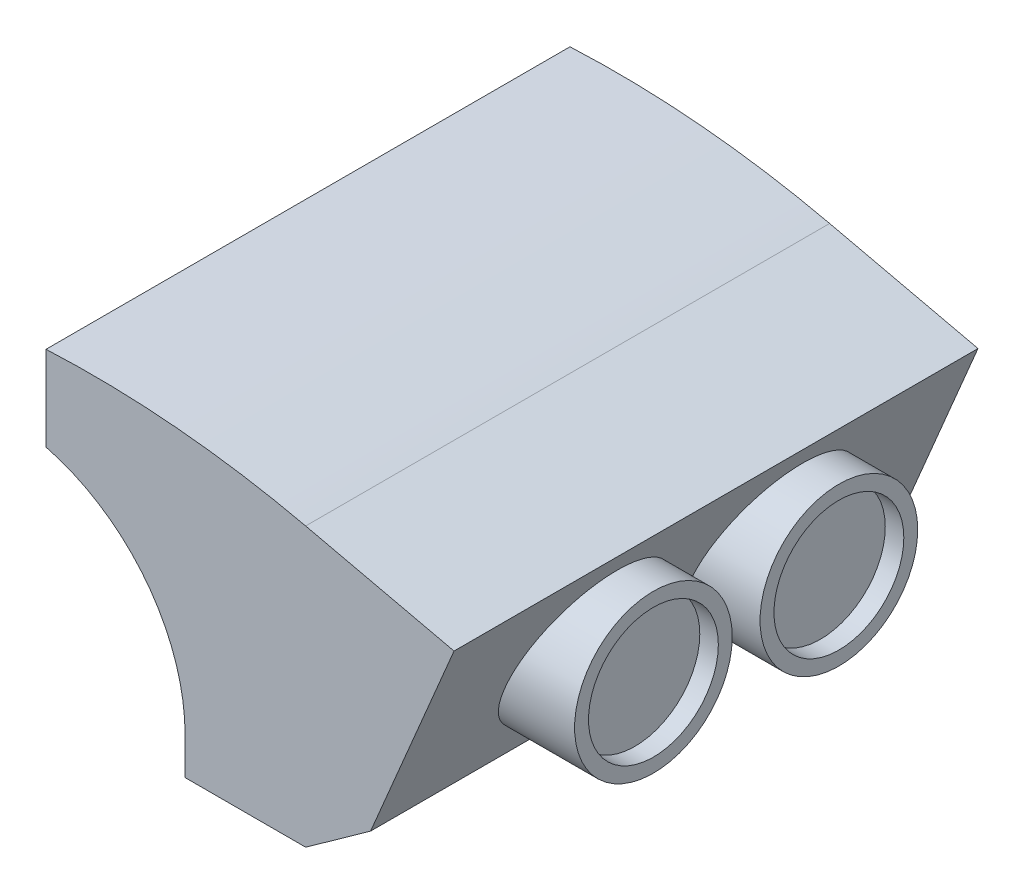
ISO-10303-21;
HEADER;
FILE_DESCRIPTION(('STEP AP214'),'2;1');
FILE_NAME('part.step','',(''),(''),'','','');
FILE_SCHEMA(('AUTOMOTIVE_DESIGN { 1 0 10303 214 1 1 1 1 }'));
ENDSEC;
DATA;
#1=APPLICATION_CONTEXT('core data for automotive mechanical design processes');
#2=APPLICATION_PROTOCOL_DEFINITION('international standard','automotive_design',2000,#1);
#3=PRODUCT_CONTEXT('',#1,'mechanical');
#4=PRODUCT('Part','Part','',(#3));
#5=PRODUCT_RELATED_PRODUCT_CATEGORY('part','',(#4));
#6=PRODUCT_DEFINITION_FORMATION('','',#4);
#7=PRODUCT_DEFINITION_CONTEXT('part definition',#1,'design');
#8=PRODUCT_DEFINITION('design','',#6,#7);
#9=PRODUCT_DEFINITION_SHAPE('','',#8);
#10=(LENGTH_UNIT() NAMED_UNIT(*) SI_UNIT(.MILLI.,.METRE.));
#11=(NAMED_UNIT(*) PLANE_ANGLE_UNIT() SI_UNIT($,.RADIAN.));
#12=(NAMED_UNIT(*) SI_UNIT($,.STERADIAN.) SOLID_ANGLE_UNIT());
#13=UNCERTAINTY_MEASURE_WITH_UNIT(LENGTH_MEASURE(1.E-05),#10,'distance_accuracy_value','');
#14=(GEOMETRIC_REPRESENTATION_CONTEXT(3) GLOBAL_UNCERTAINTY_ASSIGNED_CONTEXT((#13)) GLOBAL_UNIT_ASSIGNED_CONTEXT((#10,
#11,#12)) REPRESENTATION_CONTEXT('',''));
#15=CARTESIAN_POINT('',(0.,0.,0.));
#16=DIRECTION('',(0.,0.,1.));
#17=DIRECTION('',(1.,0.,0.));
#18=AXIS2_PLACEMENT_3D('',#15,#16,#17);
#19=CARTESIAN_POINT('',(-15.,-1.5,17.5));
#20=DIRECTION('',(0.,0.,-1.));
#21=DIRECTION('',(1.,0.,0.));
#22=AXIS2_PLACEMENT_3D('',#19,#20,#21);
#23=PLANE('',#22);
#24=DIRECTION('',(-1.,0.,0.));
#25=VECTOR('',#24,1.);
#26=CARTESIAN_POINT('',(-14.,-1.,17.5));
#27=LINE('',#26,#25);
#28=CARTESIAN_POINT('',(-14.,-1.,17.5));
#29=VERTEX_POINT('',#28);
#30=CARTESIAN_POINT('',(-15.,-1.,17.5));
#31=VERTEX_POINT('',#30);
#32=EDGE_CURVE('E272',#29,#31,#27,.T.);
#33=ORIENTED_EDGE('',*,*,#32,.F.);
#34=DIRECTION('',(0.,-1.,0.));
#35=VECTOR('',#34,1.);
#36=CARTESIAN_POINT('',(-14.,-30.,17.5));
#37=LINE('',#36,#35);
#38=CARTESIAN_POINT('',(-14.,-2.,17.5));
#39=VERTEX_POINT('',#38);
#40=EDGE_CURVE('E306',#29,#39,#37,.T.);
#41=ORIENTED_EDGE('',*,*,#40,.T.);
#42=DIRECTION('',(-1.,0.,0.));
#43=VECTOR('',#42,1.);
#44=CARTESIAN_POINT('',(-14.,-2.,17.5));
#45=LINE('',#44,#43);
#46=CARTESIAN_POINT('',(-15.,-2.,17.5));
#47=VERTEX_POINT('',#46);
#48=EDGE_CURVE('E275',#39,#47,#45,.T.);
#49=ORIENTED_EDGE('',*,*,#48,.T.);
#50=CARTESIAN_POINT('',(-15.,-1.5,17.5));
#51=DIRECTION('',(0.,0.,1.));
#52=DIRECTION('',(1.,0.,0.));
#53=AXIS2_PLACEMENT_3D('',#50,#51,#52);
#54=CIRCLE('',#53,0.5);
#55=EDGE_CURVE('E277',#31,#47,#54,.T.);
#56=ORIENTED_EDGE('',*,*,#55,.F.);
#57=EDGE_LOOP('',(#33,#41,#49,#56));
#58=FACE_BOUND('',#57,.T.);
#59=CARTESIAN_POINT('',(-15.,-1.5,17.5));
#60=DIRECTION('',(0.,0.,-1.));
#61=DIRECTION('',(-1.,0.,0.));
#62=AXIS2_PLACEMENT_3D('',#59,#60,#61);
#63=CIRCLE('',#62,0.349999999999999);
#64=CARTESIAN_POINT('',(-15.35,-1.5,17.5));
#65=VERTEX_POINT('',#64);
#66=EDGE_CURVE('E265',#65,#65,#63,.T.);
#67=ORIENTED_EDGE('',*,*,#66,.F.);
#68=EDGE_LOOP('',(#67));
#69=FACE_BOUND('',#68,.T.);
#70=ADVANCED_FACE('F36',(#58,#69),#23,.T.);
#71=CARTESIAN_POINT('',(-15.,-1.5,22.5));
#72=DIRECTION('',(0.,0.,-1.));
#73=DIRECTION('',(1.,0.,0.));
#74=AXIS2_PLACEMENT_3D('',#71,#72,#73);
#75=PLANE('',#74);
#76=DIRECTION('',(0.,-1.,0.));
#77=VECTOR('',#76,1.);
#78=CARTESIAN_POINT('',(-14.,-30.,22.5));
#79=LINE('',#78,#77);
#80=CARTESIAN_POINT('',(-14.,-1.,22.5));
#81=VERTEX_POINT('',#80);
#82=CARTESIAN_POINT('',(-14.,-2.,22.5));
#83=VERTEX_POINT('',#82);
#84=EDGE_CURVE('E302',#81,#83,#79,.T.);
#85=ORIENTED_EDGE('',*,*,#84,.F.);
#86=DIRECTION('',(-1.,0.,0.));
#87=VECTOR('',#86,1.);
#88=CARTESIAN_POINT('',(-12.5,-1.,22.5));
#89=LINE('',#88,#87);
#90=CARTESIAN_POINT('',(-15.,-1.,22.5));
#91=VERTEX_POINT('',#90);
#92=EDGE_CURVE('E268',#81,#91,#89,.T.);
#93=ORIENTED_EDGE('',*,*,#92,.T.);
#94=CARTESIAN_POINT('',(-15.,-1.5,22.5));
#95=DIRECTION('',(0.,0.,1.));
#96=DIRECTION('',(1.,0.,0.));
#97=AXIS2_PLACEMENT_3D('',#94,#95,#96);
#98=CIRCLE('',#97,0.5);
#99=CARTESIAN_POINT('',(-15.,-2.,22.5));
#100=VERTEX_POINT('',#99);
#101=EDGE_CURVE('E288',#91,#100,#98,.T.);
#102=ORIENTED_EDGE('',*,*,#101,.T.);
#103=DIRECTION('',(-1.,0.,0.));
#104=VECTOR('',#103,1.);
#105=CARTESIAN_POINT('',(-14.,-2.,22.5));
#106=LINE('',#105,#104);
#107=EDGE_CURVE('E51',#83,#100,#106,.T.);
#108=ORIENTED_EDGE('',*,*,#107,.F.);
#109=EDGE_LOOP('',(#85,#93,#102,#108));
#110=FACE_BOUND('',#109,.T.);
#111=CARTESIAN_POINT('',(-15.,-1.5,22.5));
#112=DIRECTION('',(0.,0.,-1.));
#113=DIRECTION('',(-1.,0.,0.));
#114=AXIS2_PLACEMENT_3D('',#111,#112,#113);
#115=CIRCLE('',#114,0.349999999999999);
#116=CARTESIAN_POINT('',(-15.35,-1.5,22.5));
#117=VERTEX_POINT('',#116);
#118=EDGE_CURVE('E262',#117,#117,#115,.T.);
#119=ORIENTED_EDGE('',*,*,#118,.T.);
#120=EDGE_LOOP('',(#119));
#121=FACE_BOUND('',#120,.T.);
#122=ADVANCED_FACE('F480',(#110,#121),#75,.F.);
#123=CARTESIAN_POINT('',(-14.,-30.,-28.25));
#124=DIRECTION('',(0.,0.,1.));
#125=DIRECTION('',(1.,0.,0.));
#126=AXIS2_PLACEMENT_3D('',#123,#124,#125);
#127=PLANE('',#126);
#128=DIRECTION('',(0.,1.,0.));
#129=VECTOR('',#128,1.);
#130=CARTESIAN_POINT('',(-13.,-30.,-28.25));
#131=LINE('',#130,#129);
#132=CARTESIAN_POINT('',(-13.,-6.92121597166109,-28.25));
#133=VERTEX_POINT('',#132);
#134=CARTESIAN_POINT('',(-13.,-1.,-28.25));
#135=VERTEX_POINT('',#134);
#136=EDGE_CURVE('E388',#133,#135,#131,.T.);
#137=ORIENTED_EDGE('',*,*,#136,.F.);
#138=CARTESIAN_POINT('',(-19.,-26.,-28.25));
#139=DIRECTION('',(0.,0.,1.));
#140=DIRECTION('',(1.,0.,0.));
#141=AXIS2_PLACEMENT_3D('',#138,#139,#140);
#142=CIRCLE('',#141,20.);
#143=CARTESIAN_POINT('',(-14.,-6.63508326896291,-28.25));
#144=VERTEX_POINT('',#143);
#145=EDGE_CURVE('E403',#133,#144,#142,.T.);
#146=ORIENTED_EDGE('',*,*,#145,.T.);
#147=DIRECTION('',(0.,1.,0.));
#148=VECTOR('',#147,1.);
#149=CARTESIAN_POINT('',(-14.,-30.,-28.25));
#150=LINE('',#149,#148);
#151=CARTESIAN_POINT('',(-14.,2.5,-28.25));
#152=VERTEX_POINT('',#151);
#153=EDGE_CURVE('E222',#144,#152,#150,.T.);
#154=ORIENTED_EDGE('',*,*,#153,.T.);
#155=CARTESIAN_POINT('',(-9.07429940438824,-100.382153329148,-28.25));
#156=DIRECTION('',(0.,0.,-1.));
#157=DIRECTION('',(-1.,0.,0.));
#158=AXIS2_PLACEMENT_3D('',#155,#156,#157);
#159=CIRCLE('',#158,103.);
#160=CARTESIAN_POINT('',(14.,0.,-28.25));
#161=VERTEX_POINT('',#160);
#162=EDGE_CURVE('E232',#152,#161,#159,.T.);
#163=ORIENTED_EDGE('',*,*,#162,.T.);
#164=DIRECTION('',(0.974584012904353,-0.224022324314449,0.));
#165=VECTOR('',#164,1.);
#166=CARTESIAN_POINT('',(0.702604025077475,3.05660006134751,-28.25));
#167=LINE('',#166,#165);
#168=CARTESIAN_POINT('',(30.,-3.67783294366738,-28.25));
#169=VERTEX_POINT('',#168);
#170=EDGE_CURVE('E246',#161,#169,#167,.T.);
#171=ORIENTED_EDGE('',*,*,#170,.T.);
#172=DIRECTION('',(-0.388873289291879,-0.921291248669667,0.));
#173=VECTOR('',#172,1.);
#174=CARTESIAN_POINT('',(26.7809678190315,-11.304137601703,-28.25));
#175=LINE('',#174,#173);
#176=CARTESIAN_POINT('',(21.,-25.,-28.25));
#177=VERTEX_POINT('',#176);
#178=EDGE_CURVE('E236',#169,#177,#175,.T.);
#179=ORIENTED_EDGE('',*,*,#178,.T.);
#180=DIRECTION('',(-0.813733471206735,-0.581238193719096,0.));
#181=VECTOR('',#180,1.);
#182=CARTESIAN_POINT('',(18.9189189189189,-26.4864864864865,-28.25));
#183=LINE('',#182,#181);
#184=CARTESIAN_POINT('',(14.,-30.,-28.25));
#185=VERTEX_POINT('',#184);
#186=EDGE_CURVE('E239',#177,#185,#183,.T.);
#187=ORIENTED_EDGE('',*,*,#186,.T.);
#188=DIRECTION('',(1.,0.,0.));
#189=VECTOR('',#188,1.);
#190=CARTESIAN_POINT('',(-14.,-30.,-28.25));
#191=LINE('',#190,#189);
#192=CARTESIAN_POINT('',(13.,-30.,-28.25));
#193=VERTEX_POINT('',#192);
#194=EDGE_CURVE('E223',#193,#185,#191,.T.);
#195=ORIENTED_EDGE('',*,*,#194,.F.);
#196=DIRECTION('',(0.,1.,0.));
#197=VECTOR('',#196,1.);
#198=CARTESIAN_POINT('',(13.,-30.,-28.25));
#199=LINE('',#198,#197);
#200=CARTESIAN_POINT('',(13.,-1.,-28.25));
#201=VERTEX_POINT('',#200);
#202=EDGE_CURVE('E381',#193,#201,#199,.T.);
#203=ORIENTED_EDGE('',*,*,#202,.T.);
#204=DIRECTION('',(1.,0.,0.));
#205=VECTOR('',#204,1.);
#206=CARTESIAN_POINT('',(0.,-1.,-28.25));
#207=LINE('',#206,#205);
#208=EDGE_CURVE('E387',#135,#201,#207,.T.);
#209=ORIENTED_EDGE('',*,*,#208,.F.);
#210=EDGE_LOOP('',(#137,#146,#154,#163,#171,#179,#187,#195,#203,#209));
#211=FACE_BOUND('',#210,.T.);
#212=ADVANCED_FACE('F442',(#211),#127,.F.);
#213=CARTESIAN_POINT('',(0.,-30.,0.));
#214=DIRECTION('',(0.,1.,0.));
#215=DIRECTION('',(0.,0.,1.));
#216=AXIS2_PLACEMENT_3D('',#213,#214,#215);
#217=PLANE('',#216);
#218=DIRECTION('',(0.,0.,1.));
#219=VECTOR('',#218,1.);
#220=CARTESIAN_POINT('',(13.,-30.,0.));
#221=LINE('',#220,#219);
#222=CARTESIAN_POINT('',(13.,-30.,27.25));
#223=VERTEX_POINT('',#222);
#224=EDGE_CURVE('E373',#193,#223,#221,.T.);
#225=ORIENTED_EDGE('',*,*,#224,.F.);
#226=ORIENTED_EDGE('',*,*,#194,.T.);
#227=DIRECTION('',(0.,0.,1.));
#228=VECTOR('',#227,1.);
#229=CARTESIAN_POINT('',(14.,-30.,-28.25));
#230=LINE('',#229,#228);
#231=CARTESIAN_POINT('',(14.,-30.,28.25));
#232=VERTEX_POINT('',#231);
#233=EDGE_CURVE('E418',#185,#232,#230,.T.);
#234=ORIENTED_EDGE('',*,*,#233,.T.);
#235=DIRECTION('',(1.,0.,0.));
#236=VECTOR('',#235,1.);
#237=CARTESIAN_POINT('',(-14.,-30.,28.25));
#238=LINE('',#237,#236);
#239=CARTESIAN_POINT('',(1.,-30.,28.25));
#240=VERTEX_POINT('',#239);
#241=EDGE_CURVE('E416',#240,#232,#238,.T.);
#242=ORIENTED_EDGE('',*,*,#241,.F.);
#243=DIRECTION('',(0.,0.,-1.));
#244=VECTOR('',#243,1.);
#245=CARTESIAN_POINT('',(1.,-30.,56.0154341555881));
#246=LINE('',#245,#244);
#247=CARTESIAN_POINT('',(1.,-30.,27.25));
#248=VERTEX_POINT('',#247);
#249=EDGE_CURVE('E405',#240,#248,#246,.T.);
#250=ORIENTED_EDGE('',*,*,#249,.T.);
#251=DIRECTION('',(1.,0.,0.));
#252=VECTOR('',#251,1.);
#253=CARTESIAN_POINT('',(0.,-30.,27.25));
#254=LINE('',#253,#252);
#255=EDGE_CURVE('E392',#248,#223,#254,.T.);
#256=ORIENTED_EDGE('',*,*,#255,.T.);
#257=EDGE_LOOP('',(#225,#226,#234,#242,#250,#256));
#258=FACE_BOUND('',#257,.T.);
#259=ADVANCED_FACE('F455',(#258),#217,.F.);
#260=CARTESIAN_POINT('',(-14.,-30.,-28.25));
#261=DIRECTION('',(-1.,0.,0.));
#262=DIRECTION('',(0.,0.,1.));
#263=AXIS2_PLACEMENT_3D('',#260,#261,#262);
#264=PLANE('',#263);
#265=ORIENTED_EDGE('',*,*,#40,.F.);
#266=DIRECTION('',(0.,0.,-1.));
#267=VECTOR('',#266,1.);
#268=CARTESIAN_POINT('',(-14.,-1.,-28.25));
#269=LINE('',#268,#267);
#270=EDGE_CURVE('E310',#81,#29,#269,.T.);
#271=ORIENTED_EDGE('',*,*,#270,.F.);
#272=ORIENTED_EDGE('',*,*,#84,.T.);
#273=DIRECTION('',(0.,0.,1.));
#274=VECTOR('',#273,1.);
#275=CARTESIAN_POINT('',(-14.,-2.,17.5));
#276=LINE('',#275,#274);
#277=EDGE_CURVE('E294',#39,#83,#276,.T.);
#278=ORIENTED_EDGE('',*,*,#277,.F.);
#279=EDGE_LOOP('',(#265,#271,#272,#278));
#280=FACE_BOUND('',#279,.T.);
#281=DIRECTION('',(0.,1.,0.));
#282=VECTOR('',#281,1.);
#283=CARTESIAN_POINT('',(-14.,-30.,-17.5));
#284=LINE('',#283,#282);
#285=CARTESIAN_POINT('',(-14.,-2.,-17.5));
#286=VERTEX_POINT('',#285);
#287=CARTESIAN_POINT('',(-14.,-1.,-17.5));
#288=VERTEX_POINT('',#287);
#289=EDGE_CURVE('E360',#286,#288,#284,.T.);
#290=ORIENTED_EDGE('',*,*,#289,.F.);
#291=DIRECTION('',(0.,0.,-1.));
#292=VECTOR('',#291,1.);
#293=CARTESIAN_POINT('',(-14.,-2.,-17.5));
#294=LINE('',#293,#292);
#295=CARTESIAN_POINT('',(-14.,-2.,-22.5));
#296=VERTEX_POINT('',#295);
#297=EDGE_CURVE('E344',#286,#296,#294,.T.);
#298=ORIENTED_EDGE('',*,*,#297,.T.);
#299=DIRECTION('',(0.,1.,0.));
#300=VECTOR('',#299,1.);
#301=CARTESIAN_POINT('',(-14.,-30.,-22.5));
#302=LINE('',#301,#300);
#303=CARTESIAN_POINT('',(-14.,-1.,-22.5));
#304=VERTEX_POINT('',#303);
#305=EDGE_CURVE('E355',#296,#304,#302,.T.);
#306=ORIENTED_EDGE('',*,*,#305,.T.);
#307=DIRECTION('',(0.,0.,1.));
#308=VECTOR('',#307,1.);
#309=CARTESIAN_POINT('',(-14.,-1.,-28.25));
#310=LINE('',#309,#308);
#311=EDGE_CURVE('E365',#304,#288,#310,.T.);
#312=ORIENTED_EDGE('',*,*,#311,.T.);
#313=EDGE_LOOP('',(#290,#298,#306,#312));
#314=FACE_BOUND('',#313,.T.);
#315=ORIENTED_EDGE('',*,*,#153,.F.);
#316=DIRECTION('',(0.,0.,-1.));
#317=VECTOR('',#316,1.);
#318=CARTESIAN_POINT('',(-14.,-6.63508326896291,56.0154341555881));
#319=LINE('',#318,#317);
#320=CARTESIAN_POINT('',(-14.,-6.63508326896291,28.25));
#321=VERTEX_POINT('',#320);
#322=EDGE_CURVE('E219',#321,#144,#319,.T.);
#323=ORIENTED_EDGE('',*,*,#322,.F.);
#324=DIRECTION('',(0.,1.,0.));
#325=VECTOR('',#324,1.);
#326=CARTESIAN_POINT('',(-14.,-30.,28.25));
#327=LINE('',#326,#325);
#328=CARTESIAN_POINT('',(-14.,2.5,28.25));
#329=VERTEX_POINT('',#328);
#330=EDGE_CURVE('E212',#321,#329,#327,.T.);
#331=ORIENTED_EDGE('',*,*,#330,.T.);
#332=DIRECTION('',(0.,0.,-1.));
#333=VECTOR('',#332,1.);
#334=CARTESIAN_POINT('',(-14.,2.5,62.25));
#335=LINE('',#334,#333);
#336=EDGE_CURVE('E216',#329,#152,#335,.T.);
#337=ORIENTED_EDGE('',*,*,#336,.T.);
#338=EDGE_LOOP('',(#315,#323,#331,#337));
#339=FACE_BOUND('',#338,.T.);
#340=ADVANCED_FACE('F38',(#280,#314,#339),#264,.T.);
#341=CARTESIAN_POINT('',(-14.,-30.,28.25));
#342=DIRECTION('',(0.,0.,1.));
#343=DIRECTION('',(1.,0.,0.));
#344=AXIS2_PLACEMENT_3D('',#341,#342,#343);
#345=PLANE('',#344);
#346=ORIENTED_EDGE('',*,*,#330,.F.);
#347=CARTESIAN_POINT('',(-19.,-26.,28.25));
#348=DIRECTION('',(0.,0.,1.));
#349=DIRECTION('',(1.,0.,0.));
#350=AXIS2_PLACEMENT_3D('',#347,#348,#349);
#351=CIRCLE('',#350,20.);
#352=CARTESIAN_POINT('',(1.,-26.,28.25));
#353=VERTEX_POINT('',#352);
#354=EDGE_CURVE('E408',#353,#321,#351,.T.);
#355=ORIENTED_EDGE('',*,*,#354,.F.);
#356=DIRECTION('',(0.,1.,0.));
#357=VECTOR('',#356,1.);
#358=CARTESIAN_POINT('',(1.,-30.,28.25));
#359=LINE('',#358,#357);
#360=EDGE_CURVE('E390',#240,#353,#359,.T.);
#361=ORIENTED_EDGE('',*,*,#360,.F.);
#362=ORIENTED_EDGE('',*,*,#241,.T.);
#363=DIRECTION('',(-0.813733471206735,-0.581238193719096,0.));
#364=VECTOR('',#363,1.);
#365=CARTESIAN_POINT('',(18.9189189189189,-26.4864864864865,28.25));
#366=LINE('',#365,#364);
#367=CARTESIAN_POINT('',(21.,-25.,28.25));
#368=VERTEX_POINT('',#367);
#369=EDGE_CURVE('E249',#368,#232,#366,.T.);
#370=ORIENTED_EDGE('',*,*,#369,.F.);
#371=DIRECTION('',(-0.388873289291879,-0.921291248669667,0.));
#372=VECTOR('',#371,1.);
#373=CARTESIAN_POINT('',(26.7809678190315,-11.304137601703,28.25));
#374=LINE('',#373,#372);
#375=CARTESIAN_POINT('',(30.,-3.67783294366738,28.25));
#376=VERTEX_POINT('',#375);
#377=EDGE_CURVE('E254',#376,#368,#374,.T.);
#378=ORIENTED_EDGE('',*,*,#377,.F.);
#379=DIRECTION('',(0.974584012904353,-0.224022324314449,0.));
#380=VECTOR('',#379,1.);
#381=CARTESIAN_POINT('',(0.702604025077475,3.05660006134751,28.25));
#382=LINE('',#381,#380);
#383=CARTESIAN_POINT('',(14.,0.,28.25));
#384=VERTEX_POINT('',#383);
#385=EDGE_CURVE('E229',#384,#376,#382,.T.);
#386=ORIENTED_EDGE('',*,*,#385,.F.);
#387=CARTESIAN_POINT('',(-9.07429940438824,-100.382153329148,28.25));
#388=DIRECTION('',(0.,0.,1.));
#389=DIRECTION('',(1.,0.,0.));
#390=AXIS2_PLACEMENT_3D('',#387,#388,#389);
#391=CIRCLE('',#390,103.);
#392=EDGE_CURVE('E226',#329,#384,#391,.F.);
#393=ORIENTED_EDGE('',*,*,#392,.F.);
#394=EDGE_LOOP('',(#346,#355,#361,#362,#370,#378,#386,#393));
#395=FACE_BOUND('',#394,.T.);
#396=ADVANCED_FACE('F227',(#395),#345,.T.);
#397=CARTESIAN_POINT('',(-19.,-26.,56.0154341555881));
#398=DIRECTION('',(0.,0.,-1.));
#399=DIRECTION('',(-1.,0.,0.));
#400=AXIS2_PLACEMENT_3D('',#397,#398,#399);
#401=CYLINDRICAL_SURFACE('',#400,20.);
#402=CARTESIAN_POINT('',(-19.,-26.,27.25));
#403=DIRECTION('',(0.,0.,1.));
#404=DIRECTION('',(1.,0.,0.));
#405=AXIS2_PLACEMENT_3D('',#402,#403,#404);
#406=CIRCLE('',#405,20.);
#407=CARTESIAN_POINT('',(1.,-26.,27.25));
#408=VERTEX_POINT('',#407);
#409=CARTESIAN_POINT('',(-13.,-6.92121597166108,27.25));
#410=VERTEX_POINT('',#409);
#411=EDGE_CURVE('E399',#408,#410,#406,.T.);
#412=ORIENTED_EDGE('',*,*,#411,.F.);
#413=DIRECTION('',(0.,0.,-1.));
#414=VECTOR('',#413,1.);
#415=CARTESIAN_POINT('',(1.,-26.,56.0154341555881));
#416=LINE('',#415,#414);
#417=EDGE_CURVE('E406',#353,#408,#416,.T.);
#418=ORIENTED_EDGE('',*,*,#417,.F.);
#419=ORIENTED_EDGE('',*,*,#354,.T.);
#420=ORIENTED_EDGE('',*,*,#322,.T.);
#421=ORIENTED_EDGE('',*,*,#145,.F.);
#422=DIRECTION('',(0.,0.,-1.));
#423=VECTOR('',#422,1.);
#424=CARTESIAN_POINT('',(-13.,-6.92121597166108,27.25));
#425=LINE('',#424,#423);
#426=EDGE_CURVE('E401',#410,#133,#425,.T.);
#427=ORIENTED_EDGE('',*,*,#426,.F.);
#428=EDGE_LOOP('',(#412,#418,#419,#420,#421,#427));
#429=FACE_BOUND('',#428,.T.);
#430=ADVANCED_FACE('F448',(#429),#401,.F.);
#431=CARTESIAN_POINT('',(1.,-30.,56.0154341555881));
#432=DIRECTION('',(-1.,0.,0.));
#433=DIRECTION('',(0.,0.,1.));
#434=AXIS2_PLACEMENT_3D('',#431,#432,#433);
#435=PLANE('',#434);
#436=DIRECTION('',(0.,1.,0.));
#437=VECTOR('',#436,1.);
#438=CARTESIAN_POINT('',(1.,-30.,27.25));
#439=LINE('',#438,#437);
#440=EDGE_CURVE('E368',#248,#408,#439,.T.);
#441=ORIENTED_EDGE('',*,*,#440,.F.);
#442=ORIENTED_EDGE('',*,*,#249,.F.);
#443=ORIENTED_EDGE('',*,*,#360,.T.);
#444=ORIENTED_EDGE('',*,*,#417,.T.);
#445=EDGE_LOOP('',(#441,#442,#443,#444));
#446=FACE_BOUND('',#445,.T.);
#447=ADVANCED_FACE('F468',(#446),#435,.T.);
#448=CARTESIAN_POINT('',(-13.,-30.,-28.25));
#449=DIRECTION('',(-1.,0.,0.));
#450=DIRECTION('',(0.,0.,1.));
#451=AXIS2_PLACEMENT_3D('',#448,#449,#450);
#452=PLANE('',#451);
#453=DIRECTION('',(0.,0.,1.));
#454=VECTOR('',#453,1.);
#455=CARTESIAN_POINT('',(-13.,-1.,0.));
#456=LINE('',#455,#454);
#457=CARTESIAN_POINT('',(-13.,-1.,-17.5));
#458=VERTEX_POINT('',#457);
#459=CARTESIAN_POINT('',(-13.,-1.,17.5));
#460=VERTEX_POINT('',#459);
#461=EDGE_CURVE('E378',#458,#460,#456,.T.);
#462=ORIENTED_EDGE('',*,*,#461,.T.);
#463=DIRECTION('',(0.,-1.,0.));
#464=VECTOR('',#463,1.);
#465=CARTESIAN_POINT('',(-13.,-30.,17.5));
#466=LINE('',#465,#464);
#467=CARTESIAN_POINT('',(-13.,-1.33333333333333,17.5));
#468=VERTEX_POINT('',#467);
#469=EDGE_CURVE('E59',#460,#468,#466,.T.);
#470=ORIENTED_EDGE('',*,*,#469,.T.);
#471=DIRECTION('',(0.,0.,1.));
#472=VECTOR('',#471,1.);
#473=CARTESIAN_POINT('',(-13.,-1.33333333333334,-28.25));
#474=LINE('',#473,#472);
#475=CARTESIAN_POINT('',(-13.,-1.33333333333333,22.5));
#476=VERTEX_POINT('',#475);
#477=EDGE_CURVE('E308',#468,#476,#474,.T.);
#478=ORIENTED_EDGE('',*,*,#477,.T.);
#479=DIRECTION('',(0.,-1.,0.));
#480=VECTOR('',#479,1.);
#481=CARTESIAN_POINT('',(-13.,-30.,22.5));
#482=LINE('',#481,#480);
#483=CARTESIAN_POINT('',(-13.,-1.,22.5));
#484=VERTEX_POINT('',#483);
#485=EDGE_CURVE('E299',#484,#476,#482,.T.);
#486=ORIENTED_EDGE('',*,*,#485,.F.);
#487=CARTESIAN_POINT('',(-13.,-1.,27.25));
#488=VERTEX_POINT('',#487);
#489=EDGE_CURVE('E379',#484,#488,#456,.T.);
#490=ORIENTED_EDGE('',*,*,#489,.T.);
#491=DIRECTION('',(0.,1.,0.));
#492=VECTOR('',#491,1.);
#493=CARTESIAN_POINT('',(-13.,-30.,27.25));
#494=LINE('',#493,#492);
#495=EDGE_CURVE('E369',#410,#488,#494,.T.);
#496=ORIENTED_EDGE('',*,*,#495,.F.);
#497=ORIENTED_EDGE('',*,*,#426,.T.);
#498=ORIENTED_EDGE('',*,*,#136,.T.);
#499=CARTESIAN_POINT('',(-13.,-1.,-22.5));
#500=VERTEX_POINT('',#499);
#501=EDGE_CURVE('E374',#135,#500,#456,.T.);
#502=ORIENTED_EDGE('',*,*,#501,.T.);
#503=DIRECTION('',(0.,1.,0.));
#504=VECTOR('',#503,1.);
#505=CARTESIAN_POINT('',(-13.,-30.,-22.5));
#506=LINE('',#505,#504);
#507=CARTESIAN_POINT('',(-13.,-1.33333333333333,-22.5));
#508=VERTEX_POINT('',#507);
#509=EDGE_CURVE('E352',#508,#500,#506,.T.);
#510=ORIENTED_EDGE('',*,*,#509,.F.);
#511=DIRECTION('',(0.,0.,-1.));
#512=VECTOR('',#511,1.);
#513=CARTESIAN_POINT('',(-13.,-1.33333333333334,-28.25));
#514=LINE('',#513,#512);
#515=CARTESIAN_POINT('',(-13.,-1.33333333333334,-17.5));
#516=VERTEX_POINT('',#515);
#517=EDGE_CURVE('E362',#516,#508,#514,.T.);
#518=ORIENTED_EDGE('',*,*,#517,.F.);
#519=DIRECTION('',(0.,1.,0.));
#520=VECTOR('',#519,1.);
#521=CARTESIAN_POINT('',(-13.,-30.,-17.5));
#522=LINE('',#521,#520);
#523=EDGE_CURVE('E358',#516,#458,#522,.T.);
#524=ORIENTED_EDGE('',*,*,#523,.T.);
#525=EDGE_LOOP('',(#462,#470,#478,#486,#490,#496,#497,#498,#502,#510,#518,#524));
#526=FACE_BOUND('',#525,.T.);
#527=ADVANCED_FACE('F470',(#526),#452,.F.);
#528=CARTESIAN_POINT('',(-14.,-30.,27.25));
#529=DIRECTION('',(0.,0.,1.));
#530=DIRECTION('',(1.,0.,0.));
#531=AXIS2_PLACEMENT_3D('',#528,#529,#530);
#532=PLANE('',#531);
#533=ORIENTED_EDGE('',*,*,#495,.T.);
#534=DIRECTION('',(1.,0.,0.));
#535=VECTOR('',#534,1.);
#536=CARTESIAN_POINT('',(0.,-1.,27.25));
#537=LINE('',#536,#535);
#538=CARTESIAN_POINT('',(13.,-1.,27.25));
#539=VERTEX_POINT('',#538);
#540=EDGE_CURVE('E377',#488,#539,#537,.T.);
#541=ORIENTED_EDGE('',*,*,#540,.T.);
#542=DIRECTION('',(0.,1.,0.));
#543=VECTOR('',#542,1.);
#544=CARTESIAN_POINT('',(13.,-30.,27.25));
#545=LINE('',#544,#543);
#546=EDGE_CURVE('E372',#223,#539,#545,.T.);
#547=ORIENTED_EDGE('',*,*,#546,.F.);
#548=ORIENTED_EDGE('',*,*,#255,.F.);
#549=ORIENTED_EDGE('',*,*,#440,.T.);
#550=ORIENTED_EDGE('',*,*,#411,.T.);
#551=EDGE_LOOP('',(#533,#541,#547,#548,#549,#550));
#552=FACE_BOUND('',#551,.T.);
#553=ADVANCED_FACE('F467',(#552),#532,.F.);
#554=CARTESIAN_POINT('',(13.,-30.,-28.25));
#555=DIRECTION('',(-1.,0.,0.));
#556=DIRECTION('',(0.,0.,1.));
#557=AXIS2_PLACEMENT_3D('',#554,#555,#556);
#558=PLANE('',#557);
#559=DIRECTION('',(0.,0.,1.));
#560=VECTOR('',#559,1.);
#561=CARTESIAN_POINT('',(13.,-1.,0.));
#562=LINE('',#561,#560);
#563=EDGE_CURVE('E384',#201,#539,#562,.T.);
#564=ORIENTED_EDGE('',*,*,#563,.F.);
#565=ORIENTED_EDGE('',*,*,#202,.F.);
#566=ORIENTED_EDGE('',*,*,#224,.T.);
#567=ORIENTED_EDGE('',*,*,#546,.T.);
#568=EDGE_LOOP('',(#564,#565,#566,#567));
#569=FACE_BOUND('',#568,.T.);
#570=ADVANCED_FACE('F463',(#569),#558,.T.);
#571=CARTESIAN_POINT('',(0.,-1.,0.));
#572=DIRECTION('',(0.,1.,0.));
#573=DIRECTION('',(0.,0.,1.));
#574=AXIS2_PLACEMENT_3D('',#571,#572,#573);
#575=PLANE('',#574);
#576=DIRECTION('',(0.,0.,1.));
#577=VECTOR('',#576,1.);
#578=CARTESIAN_POINT('',(-12.5,-1.,17.5));
#579=LINE('',#578,#577);
#580=CARTESIAN_POINT('',(-12.5,-1.,17.5));
#581=VERTEX_POINT('',#580);
#582=CARTESIAN_POINT('',(-12.5,-1.,22.5));
#583=VERTEX_POINT('',#582);
#584=EDGE_CURVE('E296',#581,#583,#579,.T.);
#585=ORIENTED_EDGE('',*,*,#584,.F.);
#586=EDGE_CURVE('E269',#581,#460,#27,.T.);
#587=ORIENTED_EDGE('',*,*,#586,.T.);
#588=ORIENTED_EDGE('',*,*,#461,.F.);
#589=DIRECTION('',(-1.,0.,0.));
#590=VECTOR('',#589,1.);
#591=CARTESIAN_POINT('',(-14.,-1.,-17.5));
#592=LINE('',#591,#590);
#593=CARTESIAN_POINT('',(-12.5,-1.,-17.5));
#594=VERTEX_POINT('',#593);
#595=EDGE_CURVE('E319',#594,#458,#592,.T.);
#596=ORIENTED_EDGE('',*,*,#595,.F.);
#597=DIRECTION('',(0.,0.,-1.));
#598=VECTOR('',#597,1.);
#599=CARTESIAN_POINT('',(-12.5,-1.,-17.5));
#600=LINE('',#599,#598);
#601=CARTESIAN_POINT('',(-12.5,-1.,-22.5));
#602=VERTEX_POINT('',#601);
#603=EDGE_CURVE('E331',#594,#602,#600,.T.);
#604=ORIENTED_EDGE('',*,*,#603,.T.);
#605=DIRECTION('',(-1.,0.,0.));
#606=VECTOR('',#605,1.);
#607=CARTESIAN_POINT('',(-12.5,-1.,-22.5));
#608=LINE('',#607,#606);
#609=EDGE_CURVE('E341',#602,#500,#608,.T.);
#610=ORIENTED_EDGE('',*,*,#609,.T.);
#611=ORIENTED_EDGE('',*,*,#501,.F.);
#612=ORIENTED_EDGE('',*,*,#208,.T.);
#613=ORIENTED_EDGE('',*,*,#563,.T.);
#614=ORIENTED_EDGE('',*,*,#540,.F.);
#615=ORIENTED_EDGE('',*,*,#489,.F.);
#616=EDGE_CURVE('E281',#583,#484,#89,.T.);
#617=ORIENTED_EDGE('',*,*,#616,.F.);
#618=EDGE_LOOP('',(#585,#587,#588,#596,#604,#610,#611,#612,#613,#614,#615,#617));
#619=FACE_BOUND('',#618,.T.);
#620=ADVANCED_FACE('F509',(#619),#575,.F.);
#621=CARTESIAN_POINT('',(-15.,-1.5,-22.5));
#622=DIRECTION('',(0.,0.,1.));
#623=DIRECTION('',(1.,0.,0.));
#624=AXIS2_PLACEMENT_3D('',#621,#622,#623);
#625=PLANE('',#624);
#626=DIRECTION('',(0.832050294337844,0.554700196225229,0.));
#627=VECTOR('',#626,1.);
#628=CARTESIAN_POINT('',(-14.,-2.,-22.5));
#629=LINE('',#628,#627);
#630=EDGE_CURVE('E337',#508,#602,#629,.T.);
#631=ORIENTED_EDGE('',*,*,#630,.F.);
#632=ORIENTED_EDGE('',*,*,#509,.T.);
#633=ORIENTED_EDGE('',*,*,#609,.F.);
#634=EDGE_LOOP('',(#631,#632,#633));
#635=FACE_BOUND('',#634,.T.);
#636=ADVANCED_FACE('F524',(#635),#625,.F.);
#637=CARTESIAN_POINT('',(-15.,-1.5,-17.5));
#638=DIRECTION('',(0.,0.,1.));
#639=DIRECTION('',(1.,0.,0.));
#640=AXIS2_PLACEMENT_3D('',#637,#638,#639);
#641=PLANE('',#640);
#642=ORIENTED_EDGE('',*,*,#523,.F.);
#643=DIRECTION('',(0.832050294337844,0.554700196225229,0.));
#644=VECTOR('',#643,1.);
#645=CARTESIAN_POINT('',(-14.,-2.,-17.5));
#646=LINE('',#645,#644);
#647=EDGE_CURVE('E328',#516,#594,#646,.T.);
#648=ORIENTED_EDGE('',*,*,#647,.T.);
#649=ORIENTED_EDGE('',*,*,#595,.T.);
#650=EDGE_LOOP('',(#642,#648,#649));
#651=FACE_BOUND('',#650,.T.);
#652=ADVANCED_FACE('F515',(#651),#641,.T.);
#653=CARTESIAN_POINT('',(-14.,-2.,-17.5));
#654=DIRECTION('',(-0.554700196225229,0.832050294337844,0.));
#655=DIRECTION('',(-0.832050294337844,-0.554700196225229,0.));
#656=AXIS2_PLACEMENT_3D('',#653,#654,#655);
#657=PLANE('',#656);
#658=ORIENTED_EDGE('',*,*,#647,.F.);
#659=ORIENTED_EDGE('',*,*,#517,.T.);
#660=ORIENTED_EDGE('',*,*,#630,.T.);
#661=ORIENTED_EDGE('',*,*,#603,.F.);
#662=EDGE_LOOP('',(#658,#659,#660,#661));
#663=FACE_BOUND('',#662,.T.);
#664=ADVANCED_FACE('F519',(#663),#657,.F.);
#665=CARTESIAN_POINT('',(-15.,-1.5,-17.5));
#666=DIRECTION('',(0.,0.,-1.));
#667=DIRECTION('',(-1.,0.,0.));
#668=AXIS2_PLACEMENT_3D('',#665,#666,#667);
#669=CYLINDRICAL_SURFACE('',#668,0.5);
#670=CARTESIAN_POINT('',(-15.,-1.5,-22.5));
#671=DIRECTION('',(0.,0.,1.));
#672=DIRECTION('',(1.,0.,0.));
#673=AXIS2_PLACEMENT_3D('',#670,#671,#672);
#674=CIRCLE('',#673,0.5);
#675=CARTESIAN_POINT('',(-15.,-1.,-22.5));
#676=VERTEX_POINT('',#675);
#677=CARTESIAN_POINT('',(-15.,-2.,-22.5));
#678=VERTEX_POINT('',#677);
#679=EDGE_CURVE('E318',#676,#678,#674,.T.);
#680=ORIENTED_EDGE('',*,*,#679,.T.);
#681=DIRECTION('',(0.,0.,-1.));
#682=VECTOR('',#681,1.);
#683=CARTESIAN_POINT('',(-15.,-2.,-17.5));
#684=LINE('',#683,#682);
#685=CARTESIAN_POINT('',(-15.,-2.,-17.5));
#686=VERTEX_POINT('',#685);
#687=EDGE_CURVE('E347',#686,#678,#684,.T.);
#688=ORIENTED_EDGE('',*,*,#687,.F.);
#689=CARTESIAN_POINT('',(-15.,-1.5,-17.5));
#690=DIRECTION('',(0.,0.,1.));
#691=DIRECTION('',(1.,0.,0.));
#692=AXIS2_PLACEMENT_3D('',#689,#690,#691);
#693=CIRCLE('',#692,0.5);
#694=CARTESIAN_POINT('',(-15.,-1.,-17.5));
#695=VERTEX_POINT('',#694);
#696=EDGE_CURVE('E322',#695,#686,#693,.T.);
#697=ORIENTED_EDGE('',*,*,#696,.F.);
#698=DIRECTION('',(0.,0.,-1.));
#699=VECTOR('',#698,1.);
#700=CARTESIAN_POINT('',(-15.,-1.,-17.5));
#701=LINE('',#700,#699);
#702=EDGE_CURVE('E349',#695,#676,#701,.T.);
#703=ORIENTED_EDGE('',*,*,#702,.T.);
#704=EDGE_LOOP('',(#680,#688,#697,#703));
#705=FACE_BOUND('',#704,.T.);
#706=ADVANCED_FACE('F562',(#705),#669,.T.);
#707=CARTESIAN_POINT('',(-14.,-2.,-17.5));
#708=DIRECTION('',(0.,-1.,0.));
#709=DIRECTION('',(0.,0.,-1.));
#710=AXIS2_PLACEMENT_3D('',#707,#708,#709);
#711=PLANE('',#710);
#712=DIRECTION('',(-1.,0.,0.));
#713=VECTOR('',#712,1.);
#714=CARTESIAN_POINT('',(-14.,-2.,-22.5));
#715=LINE('',#714,#713);
#716=EDGE_CURVE('E334',#296,#678,#715,.T.);
#717=ORIENTED_EDGE('',*,*,#716,.F.);
#718=ORIENTED_EDGE('',*,*,#297,.F.);
#719=DIRECTION('',(-1.,0.,0.));
#720=VECTOR('',#719,1.);
#721=CARTESIAN_POINT('',(-14.,-2.,-17.5));
#722=LINE('',#721,#720);
#723=EDGE_CURVE('E325',#286,#686,#722,.T.);
#724=ORIENTED_EDGE('',*,*,#723,.T.);
#725=ORIENTED_EDGE('',*,*,#687,.T.);
#726=EDGE_LOOP('',(#717,#718,#724,#725));
#727=FACE_BOUND('',#726,.T.);
#728=ADVANCED_FACE('F552',(#727),#711,.T.);
#729=CARTESIAN_POINT('',(-12.5,-1.,-17.5));
#730=DIRECTION('',(0.,-1.,0.));
#731=DIRECTION('',(0.,0.,-1.));
#732=AXIS2_PLACEMENT_3D('',#729,#730,#731);
#733=PLANE('',#732);
#734=ORIENTED_EDGE('',*,*,#311,.F.);
#735=EDGE_CURVE('E340',#304,#676,#608,.T.);
#736=ORIENTED_EDGE('',*,*,#735,.T.);
#737=ORIENTED_EDGE('',*,*,#702,.F.);
#738=EDGE_CURVE('E323',#288,#695,#592,.T.);
#739=ORIENTED_EDGE('',*,*,#738,.F.);
#740=EDGE_LOOP('',(#734,#736,#737,#739));
#741=FACE_BOUND('',#740,.T.);
#742=ADVANCED_FACE('F543',(#741),#733,.F.);
#743=CARTESIAN_POINT('',(-15.,-1.5,-17.5));
#744=DIRECTION('',(0.,0.,1.));
#745=DIRECTION('',(1.,0.,0.));
#746=AXIS2_PLACEMENT_3D('',#743,#744,#745);
#747=CIRCLE('',#746,0.349999999999999);
#748=CARTESIAN_POINT('',(-14.65,-1.5,-17.5));
#749=VERTEX_POINT('',#748);
#750=EDGE_CURVE('E315',#749,#749,#747,.F.);
#751=ORIENTED_EDGE('',*,*,#750,.T.);
#752=EDGE_LOOP('',(#751));
#753=FACE_BOUND('',#752,.T.);
#754=ORIENTED_EDGE('',*,*,#723,.F.);
#755=ORIENTED_EDGE('',*,*,#289,.T.);
#756=ORIENTED_EDGE('',*,*,#738,.T.);
#757=ORIENTED_EDGE('',*,*,#696,.T.);
#758=EDGE_LOOP('',(#754,#755,#756,#757));
#759=FACE_BOUND('',#758,.T.);
#760=ADVANCED_FACE('F533',(#753,#759),#641,.T.);
#761=CARTESIAN_POINT('',(-15.,-1.5,-22.5));
#762=DIRECTION('',(0.,0.,-1.));
#763=DIRECTION('',(-1.,0.,0.));
#764=AXIS2_PLACEMENT_3D('',#761,#762,#763);
#765=CIRCLE('',#764,0.349999999999999);
#766=CARTESIAN_POINT('',(-15.35,-1.5,-22.5));
#767=VERTEX_POINT('',#766);
#768=EDGE_CURVE('E312',#767,#767,#765,.T.);
#769=ORIENTED_EDGE('',*,*,#768,.F.);
#770=EDGE_LOOP('',(#769));
#771=FACE_BOUND('',#770,.T.);
#772=ORIENTED_EDGE('',*,*,#305,.F.);
#773=ORIENTED_EDGE('',*,*,#716,.T.);
#774=ORIENTED_EDGE('',*,*,#679,.F.);
#775=ORIENTED_EDGE('',*,*,#735,.F.);
#776=EDGE_LOOP('',(#772,#773,#774,#775));
#777=FACE_BOUND('',#776,.T.);
#778=ADVANCED_FACE('F527',(#771,#777),#625,.F.);
#779=CARTESIAN_POINT('',(-15.,-1.5,-16.5100505063388));
#780=DIRECTION('',(0.,0.,-1.));
#781=DIRECTION('',(-1.,0.,0.));
#782=AXIS2_PLACEMENT_3D('',#779,#780,#781);
#783=CYLINDRICAL_SURFACE('',#782,0.349999999999999);
#784=ORIENTED_EDGE('',*,*,#768,.T.);
#785=EDGE_LOOP('',(#784));
#786=FACE_BOUND('',#785,.T.);
#787=ORIENTED_EDGE('',*,*,#750,.F.);
#788=EDGE_LOOP('',(#787));
#789=FACE_BOUND('',#788,.T.);
#790=ADVANCED_FACE('F502',(#786,#789),#783,.F.);
#791=ORIENTED_EDGE('',*,*,#616,.T.);
#792=ORIENTED_EDGE('',*,*,#485,.T.);
#793=DIRECTION('',(0.832050294337844,0.554700196225229,0.));
#794=VECTOR('',#793,1.);
#795=CARTESIAN_POINT('',(-14.,-2.,22.5));
#796=LINE('',#795,#794);
#797=EDGE_CURVE('E284',#476,#583,#796,.T.);
#798=ORIENTED_EDGE('',*,*,#797,.T.);
#799=EDGE_LOOP('',(#791,#792,#798));
#800=FACE_BOUND('',#799,.T.);
#801=ADVANCED_FACE('F488',(#800),#75,.F.);
#802=ORIENTED_EDGE('',*,*,#469,.F.);
#803=ORIENTED_EDGE('',*,*,#586,.F.);
#804=DIRECTION('',(0.832050294337844,0.554700196225229,0.));
#805=VECTOR('',#804,1.);
#806=CARTESIAN_POINT('',(-14.,-2.,17.5));
#807=LINE('',#806,#805);
#808=EDGE_CURVE('E271',#468,#581,#807,.T.);
#809=ORIENTED_EDGE('',*,*,#808,.F.);
#810=EDGE_LOOP('',(#802,#803,#809));
#811=FACE_BOUND('',#810,.T.);
#812=ADVANCED_FACE('F483',(#811),#23,.T.);
#813=CARTESIAN_POINT('',(-14.,-2.,17.5));
#814=DIRECTION('',(0.554700196225229,-0.832050294337844,0.));
#815=DIRECTION('',(0.832050294337844,0.554700196225229,0.));
#816=AXIS2_PLACEMENT_3D('',#813,#814,#815);
#817=PLANE('',#816);
#818=ORIENTED_EDGE('',*,*,#477,.F.);
#819=ORIENTED_EDGE('',*,*,#808,.T.);
#820=ORIENTED_EDGE('',*,*,#584,.T.);
#821=ORIENTED_EDGE('',*,*,#797,.F.);
#822=EDGE_LOOP('',(#818,#819,#820,#821));
#823=FACE_BOUND('',#822,.T.);
#824=ADVANCED_FACE('F493',(#823),#817,.T.);
#825=CARTESIAN_POINT('',(-12.5,-1.,17.5));
#826=DIRECTION('',(0.,1.,0.));
#827=DIRECTION('',(0.,0.,1.));
#828=AXIS2_PLACEMENT_3D('',#825,#826,#827);
#829=PLANE('',#828);
#830=ORIENTED_EDGE('',*,*,#92,.F.);
#831=ORIENTED_EDGE('',*,*,#270,.T.);
#832=ORIENTED_EDGE('',*,*,#32,.T.);
#833=DIRECTION('',(0.,0.,1.));
#834=VECTOR('',#833,1.);
#835=CARTESIAN_POINT('',(-15.,-1.,17.5));
#836=LINE('',#835,#834);
#837=EDGE_CURVE('E280',#31,#91,#836,.T.);
#838=ORIENTED_EDGE('',*,*,#837,.T.);
#839=EDGE_LOOP('',(#830,#831,#832,#838));
#840=FACE_BOUND('',#839,.T.);
#841=ADVANCED_FACE('F499',(#840),#829,.T.);
#842=CARTESIAN_POINT('',(-14.,-2.,17.5));
#843=DIRECTION('',(0.,1.,0.));
#844=DIRECTION('',(0.,0.,1.));
#845=AXIS2_PLACEMENT_3D('',#842,#843,#844);
#846=PLANE('',#845);
#847=ORIENTED_EDGE('',*,*,#107,.T.);
#848=DIRECTION('',(0.,0.,1.));
#849=VECTOR('',#848,1.);
#850=CARTESIAN_POINT('',(-15.,-2.,17.5));
#851=LINE('',#850,#849);
#852=EDGE_CURVE('E292',#47,#100,#851,.T.);
#853=ORIENTED_EDGE('',*,*,#852,.F.);
#854=ORIENTED_EDGE('',*,*,#48,.F.);
#855=ORIENTED_EDGE('',*,*,#277,.T.);
#856=EDGE_LOOP('',(#847,#853,#854,#855));
#857=FACE_BOUND('',#856,.T.);
#858=ADVANCED_FACE('F619',(#857),#846,.F.);
#859=CARTESIAN_POINT('',(-15.,-1.5,17.5));
#860=DIRECTION('',(0.,0.,1.));
#861=DIRECTION('',(1.,0.,0.));
#862=AXIS2_PLACEMENT_3D('',#859,#860,#861);
#863=CYLINDRICAL_SURFACE('',#862,0.5);
#864=ORIENTED_EDGE('',*,*,#101,.F.);
#865=ORIENTED_EDGE('',*,*,#837,.F.);
#866=ORIENTED_EDGE('',*,*,#55,.T.);
#867=ORIENTED_EDGE('',*,*,#852,.T.);
#868=EDGE_LOOP('',(#864,#865,#866,#867));
#869=FACE_BOUND('',#868,.T.);
#870=ADVANCED_FACE('F613',(#869),#863,.T.);
#871=CARTESIAN_POINT('',(-15.,-1.5,-18.4899494936612));
#872=DIRECTION('',(0.,0.,1.));
#873=DIRECTION('',(1.,0.,0.));
#874=AXIS2_PLACEMENT_3D('',#871,#872,#873);
#875=CYLINDRICAL_SURFACE('',#874,0.349999999999999);
#876=ORIENTED_EDGE('',*,*,#118,.F.);
#877=EDGE_LOOP('',(#876));
#878=FACE_BOUND('',#877,.T.);
#879=ORIENTED_EDGE('',*,*,#66,.T.);
#880=EDGE_LOOP('',(#879));
#881=FACE_BOUND('',#880,.T.);
#882=ADVANCED_FACE('F618',(#878,#881),#875,.F.);
#883=CARTESIAN_POINT('',(18.9189189189189,-26.4864864864865,62.25));
#884=DIRECTION('',(0.581238193719096,-0.813733471206735,0.));
#885=DIRECTION('',(0.813733471206735,0.581238193719096,0.));
#886=AXIS2_PLACEMENT_3D('',#883,#884,#885);
#887=PLANE('',#886);
#888=DIRECTION('',(0.,0.,-1.));
#889=VECTOR('',#888,1.);
#890=CARTESIAN_POINT('',(21.,-25.,62.25));
#891=LINE('',#890,#889);
#892=EDGE_CURVE('E257',#368,#177,#891,.T.);
#893=ORIENTED_EDGE('',*,*,#892,.F.);
#894=ORIENTED_EDGE('',*,*,#369,.T.);
#895=ORIENTED_EDGE('',*,*,#233,.F.);
#896=ORIENTED_EDGE('',*,*,#186,.F.);
#897=EDGE_LOOP('',(#893,#894,#895,#896));
#898=FACE_BOUND('',#897,.T.);
#899=ADVANCED_FACE('F460',(#898),#887,.T.);
#900=CARTESIAN_POINT('',(0.702604025077475,3.05660006134751,62.25));
#901=DIRECTION('',(0.224022324314449,0.974584012904353,0.));
#902=DIRECTION('',(-0.974584012904353,0.224022324314449,0.));
#903=AXIS2_PLACEMENT_3D('',#900,#901,#902);
#904=PLANE('',#903);
#905=DIRECTION('',(0.,0.,1.));
#906=VECTOR('',#905,1.);
#907=CARTESIAN_POINT('',(14.,0.,-28.25));
#908=LINE('',#907,#906);
#909=EDGE_CURVE('E415',#161,#384,#908,.T.);
#910=ORIENTED_EDGE('',*,*,#909,.T.);
#911=ORIENTED_EDGE('',*,*,#385,.T.);
#912=DIRECTION('',(0.,0.,-1.));
#913=VECTOR('',#912,1.);
#914=CARTESIAN_POINT('',(30.,-3.67783294366738,62.25));
#915=LINE('',#914,#913);
#916=EDGE_CURVE('E258',#376,#169,#915,.T.);
#917=ORIENTED_EDGE('',*,*,#916,.T.);
#918=ORIENTED_EDGE('',*,*,#170,.F.);
#919=EDGE_LOOP('',(#910,#911,#917,#918));
#920=FACE_BOUND('',#919,.T.);
#921=ADVANCED_FACE('F432',(#920),#904,.T.);
#922=CARTESIAN_POINT('',(26.7809678190315,-11.304137601703,62.25));
#923=DIRECTION('',(0.921291248669667,-0.388873289291879,0.));
#924=DIRECTION('',(0.388873289291879,0.921291248669667,0.));
#925=AXIS2_PLACEMENT_3D('',#922,#923,#924);
#926=PLANE('',#925);
#927=CARTESIAN_POINT('',(25.5,-14.3389164718337,9.75));
#928=DIRECTION('',(0.921291248669667,-0.388873289291879,0.));
#929=DIRECTION('',(0.388873289291879,0.921291248669667,0.));
#930=AXIS2_PLACEMENT_3D('',#927,#928,#929);
#931=ELLIPSE('',#930,9.22618120195312,8.5);
#932=CARTESIAN_POINT('',(29.0878154316064,-5.83891647183369,9.75));
#933=VERTEX_POINT('',#932);
#934=EDGE_CURVE('E11',#933,#933,#931,.T.);
#935=ORIENTED_EDGE('',*,*,#934,.F.);
#936=EDGE_LOOP('',(#935));
#937=FACE_BOUND('',#936,.T.);
#938=CARTESIAN_POINT('',(25.5,-14.3389164718337,-10.25));
#939=DIRECTION('',(0.921291248669667,-0.388873289291879,0.));
#940=DIRECTION('',(0.388873289291879,0.921291248669667,0.));
#941=AXIS2_PLACEMENT_3D('',#938,#939,#940);
#942=ELLIPSE('',#941,9.22618120195312,8.5);
#943=CARTESIAN_POINT('',(29.0878154316064,-5.83891647183369,-10.25));
#944=VERTEX_POINT('',#943);
#945=EDGE_CURVE('E44',#944,#944,#942,.T.);
#946=ORIENTED_EDGE('',*,*,#945,.F.);
#947=EDGE_LOOP('',(#946));
#948=FACE_BOUND('',#947,.T.);
#949=ORIENTED_EDGE('',*,*,#916,.F.);
#950=ORIENTED_EDGE('',*,*,#377,.T.);
#951=ORIENTED_EDGE('',*,*,#892,.T.);
#952=ORIENTED_EDGE('',*,*,#178,.F.);
#953=EDGE_LOOP('',(#949,#950,#951,#952));
#954=FACE_BOUND('',#953,.T.);
#955=ADVANCED_FACE('F429',(#937,#948,#954),#926,.T.);
#956=CARTESIAN_POINT('',(-9.07429940438824,-100.382153329148,62.25));
#957=DIRECTION('',(0.,0.,-1.));
#958=DIRECTION('',(-1.,0.,0.));
#959=AXIS2_PLACEMENT_3D('',#956,#957,#958);
#960=CYLINDRICAL_SURFACE('',#959,103.);
#961=ORIENTED_EDGE('',*,*,#336,.F.);
#962=ORIENTED_EDGE('',*,*,#392,.T.);
#963=ORIENTED_EDGE('',*,*,#909,.F.);
#964=ORIENTED_EDGE('',*,*,#162,.F.);
#965=EDGE_LOOP('',(#961,#962,#963,#964));
#966=FACE_BOUND('',#965,.T.);
#967=ADVANCED_FACE('F234',(#966),#960,.T.);
#968=CARTESIAN_POINT('',(0.431394135114893,-14.3389164718337,-10.25));
#969=DIRECTION('',(1.,0.,0.));
#970=DIRECTION('',(0.,0.,-1.));
#971=AXIS2_PLACEMENT_3D('',#968,#969,#970);
#972=CYLINDRICAL_SURFACE('',#971,8.5);
#973=ORIENTED_EDGE('',*,*,#945,.T.);
#974=EDGE_LOOP('',(#973));
#975=FACE_BOUND('',#974,.T.);
#976=CARTESIAN_POINT('',(33.,-14.3389164718337,-10.25));
#977=DIRECTION('',(1.,0.,0.));
#978=DIRECTION('',(0.,0.,-1.));
#979=AXIS2_PLACEMENT_3D('',#976,#977,#978);
#980=CIRCLE('',#979,8.5);
#981=CARTESIAN_POINT('',(33.,-14.3389164718337,-18.75));
#982=VERTEX_POINT('',#981);
#983=EDGE_CURVE('E242',#982,#982,#980,.T.);
#984=ORIENTED_EDGE('',*,*,#983,.F.);
#985=EDGE_LOOP('',(#984));
#986=FACE_BOUND('',#985,.T.);
#987=ADVANCED_FACE('F426',(#975,#986),#972,.T.);
#988=CARTESIAN_POINT('',(33.,-14.3389164718337,-10.25));
#989=DIRECTION('',(1.,0.,0.));
#990=DIRECTION('',(0.,0.,-1.));
#991=AXIS2_PLACEMENT_3D('',#988,#989,#990);
#992=PLANE('',#991);
#993=CARTESIAN_POINT('',(33.,-14.3389164718337,-10.25));
#994=DIRECTION('',(1.,0.,0.));
#995=DIRECTION('',(0.,0.,-1.));
#996=AXIS2_PLACEMENT_3D('',#993,#994,#995);
#997=CIRCLE('',#996,7.);
#998=CARTESIAN_POINT('',(33.,-14.3389164718337,-17.25));
#999=VERTEX_POINT('',#998);
#1000=EDGE_CURVE('E953',#999,#999,#997,.T.);
#1001=ORIENTED_EDGE('',*,*,#1000,.F.);
#1002=EDGE_LOOP('',(#1001));
#1003=FACE_BOUND('',#1002,.T.);
#1004=ORIENTED_EDGE('',*,*,#983,.T.);
#1005=EDGE_LOOP('',(#1004));
#1006=FACE_BOUND('',#1005,.T.);
#1007=ADVANCED_FACE('F690',(#1003,#1006),#992,.T.);
#1008=CARTESIAN_POINT('',(31.,-14.3389164718337,-10.25));
#1009=DIRECTION('',(1.,0.,0.));
#1010=DIRECTION('',(0.,0.,-1.));
#1011=AXIS2_PLACEMENT_3D('',#1008,#1009,#1010);
#1012=CYLINDRICAL_SURFACE('',#1011,7.);
#1013=CARTESIAN_POINT('',(31.,-14.3389164718337,-10.25));
#1014=DIRECTION('',(1.,0.,0.));
#1015=DIRECTION('',(0.,0.,-1.));
#1016=AXIS2_PLACEMENT_3D('',#1013,#1014,#1015);
#1017=CIRCLE('',#1016,7.);
#1018=CARTESIAN_POINT('',(31.,-14.3389164718337,-17.25));
#1019=VERTEX_POINT('',#1018);
#1020=EDGE_CURVE('E952',#1019,#1019,#1017,.T.);
#1021=ORIENTED_EDGE('',*,*,#1020,.F.);
#1022=EDGE_LOOP('',(#1021));
#1023=FACE_BOUND('',#1022,.T.);
#1024=ORIENTED_EDGE('',*,*,#1000,.T.);
#1025=EDGE_LOOP('',(#1024));
#1026=FACE_BOUND('',#1025,.T.);
#1027=ADVANCED_FACE('F684',(#1023,#1026),#1012,.F.);
#1028=CARTESIAN_POINT('',(31.,-14.3389164718337,-10.25));
#1029=DIRECTION('',(1.,0.,0.));
#1030=DIRECTION('',(0.,0.,-1.));
#1031=AXIS2_PLACEMENT_3D('',#1028,#1029,#1030);
#1032=PLANE('',#1031);
#1033=ORIENTED_EDGE('',*,*,#1020,.T.);
#1034=EDGE_LOOP('',(#1033));
#1035=FACE_BOUND('',#1034,.T.);
#1036=ADVANCED_FACE('F689',(#1035),#1032,.T.);
#1037=CARTESIAN_POINT('',(0.431394135114893,-14.3389164718337,9.75));
#1038=DIRECTION('',(1.,0.,0.));
#1039=DIRECTION('',(0.,0.,-1.));
#1040=AXIS2_PLACEMENT_3D('',#1037,#1038,#1039);
#1041=CYLINDRICAL_SURFACE('',#1040,8.5);
#1042=ORIENTED_EDGE('',*,*,#934,.T.);
#1043=EDGE_LOOP('',(#1042));
#1044=FACE_BOUND('',#1043,.T.);
#1045=CARTESIAN_POINT('',(33.,-14.3389164718337,9.75));
#1046=DIRECTION('',(1.,0.,0.));
#1047=DIRECTION('',(0.,0.,-1.));
#1048=AXIS2_PLACEMENT_3D('',#1045,#1046,#1047);
#1049=CIRCLE('',#1048,8.5);
#1050=CARTESIAN_POINT('',(33.,-14.3389164718337,1.25));
#1051=VERTEX_POINT('',#1050);
#1052=EDGE_CURVE('E957',#1051,#1051,#1049,.T.);
#1053=ORIENTED_EDGE('',*,*,#1052,.F.);
#1054=EDGE_LOOP('',(#1053));
#1055=FACE_BOUND('',#1054,.T.);
#1056=ADVANCED_FACE('F753',(#1044,#1055),#1041,.T.);
#1057=CARTESIAN_POINT('',(33.,-14.3389164718337,9.75));
#1058=DIRECTION('',(1.,0.,0.));
#1059=DIRECTION('',(0.,0.,-1.));
#1060=AXIS2_PLACEMENT_3D('',#1057,#1058,#1059);
#1061=PLANE('',#1060);
#1062=CARTESIAN_POINT('',(33.,-14.3389164718337,9.75));
#1063=DIRECTION('',(1.,0.,0.));
#1064=DIRECTION('',(0.,0.,-1.));
#1065=AXIS2_PLACEMENT_3D('',#1062,#1063,#1064);
#1066=CIRCLE('',#1065,7.);
#1067=CARTESIAN_POINT('',(33.,-14.3389164718337,2.75));
#1068=VERTEX_POINT('',#1067);
#1069=EDGE_CURVE('E962',#1068,#1068,#1066,.T.);
#1070=ORIENTED_EDGE('',*,*,#1069,.F.);
#1071=EDGE_LOOP('',(#1070));
#1072=FACE_BOUND('',#1071,.T.);
#1073=ORIENTED_EDGE('',*,*,#1052,.T.);
#1074=EDGE_LOOP('',(#1073));
#1075=FACE_BOUND('',#1074,.T.);
#1076=ADVANCED_FACE('F705',(#1072,#1075),#1061,.T.);
#1077=CARTESIAN_POINT('',(31.,-14.3389164718337,9.75));
#1078=DIRECTION('',(1.,0.,0.));
#1079=DIRECTION('',(0.,0.,-1.));
#1080=AXIS2_PLACEMENT_3D('',#1077,#1078,#1079);
#1081=CYLINDRICAL_SURFACE('',#1080,7.);
#1082=CARTESIAN_POINT('',(31.,-14.3389164718337,9.75));
#1083=DIRECTION('',(1.,0.,0.));
#1084=DIRECTION('',(0.,0.,-1.));
#1085=AXIS2_PLACEMENT_3D('',#1082,#1083,#1084);
#1086=CIRCLE('',#1085,7.);
#1087=CARTESIAN_POINT('',(31.,-14.3389164718337,2.75));
#1088=VERTEX_POINT('',#1087);
#1089=EDGE_CURVE('E961',#1088,#1088,#1086,.T.);
#1090=ORIENTED_EDGE('',*,*,#1089,.F.);
#1091=EDGE_LOOP('',(#1090));
#1092=FACE_BOUND('',#1091,.T.);
#1093=ORIENTED_EDGE('',*,*,#1069,.T.);
#1094=EDGE_LOOP('',(#1093));
#1095=FACE_BOUND('',#1094,.T.);
#1096=ADVANCED_FACE('F700',(#1092,#1095),#1081,.F.);
#1097=CARTESIAN_POINT('',(31.,-14.3389164718337,9.75));
#1098=DIRECTION('',(1.,0.,0.));
#1099=DIRECTION('',(0.,0.,-1.));
#1100=AXIS2_PLACEMENT_3D('',#1097,#1098,#1099);
#1101=PLANE('',#1100);
#1102=ORIENTED_EDGE('',*,*,#1089,.T.);
#1103=EDGE_LOOP('',(#1102));
#1104=FACE_BOUND('',#1103,.T.);
#1105=ADVANCED_FACE('F704',(#1104),#1101,.T.);
#1106=CLOSED_SHELL('',(#70,#122,#212,#259,#340,#396,#430,#447,#527,#553,#570,#620,#636,#652,
#664,#706,#728,#742,#760,#778,#790,#801,#812,#824,#841,#858,#870,#882,#899,#921,#955,#967,#987,
#1007,#1027,#1036,#1056,#1076,#1096,#1105));
#1107=MANIFOLD_SOLID_BREP('B2',#1106);
#1108=ADVANCED_BREP_SHAPE_REPRESENTATION('',(#18,#1107),#14);
#1109=SHAPE_DEFINITION_REPRESENTATION(#9,#1108);
ENDSEC;
END-ISO-10303-21;
